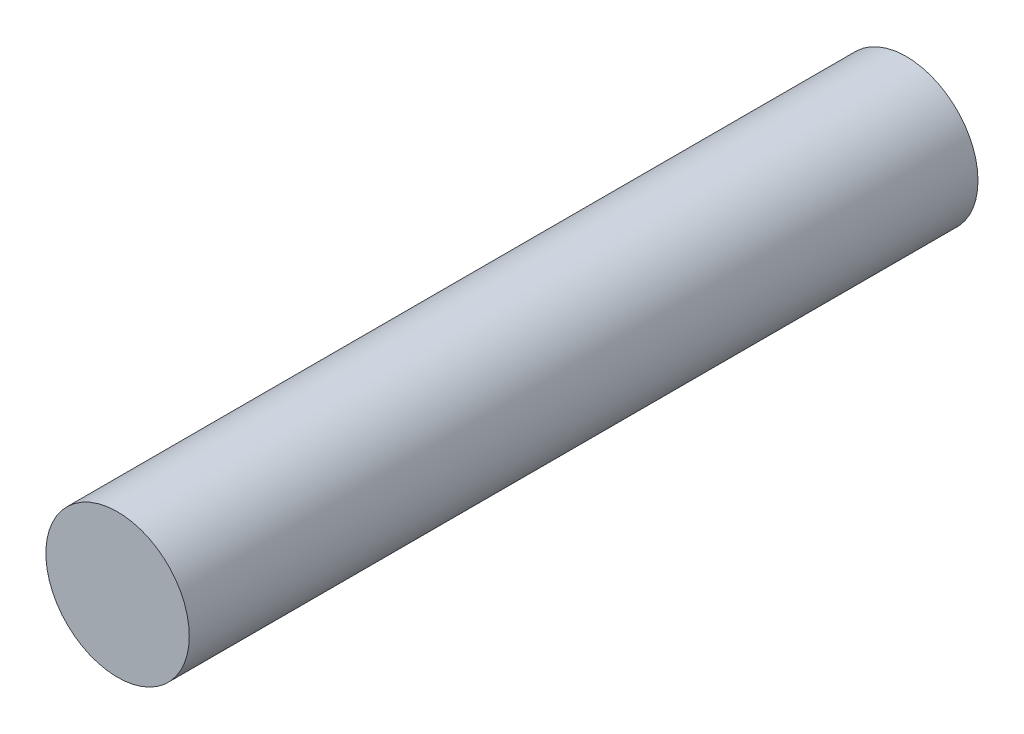
ISO-10303-21;
HEADER;
FILE_DESCRIPTION(('STEP AP214'),'2;1');
FILE_NAME('part.step','',(''),(''),'','','');
FILE_SCHEMA(('AUTOMOTIVE_DESIGN { 1 0 10303 214 1 1 1 1 }'));
ENDSEC;
DATA;
#1=APPLICATION_CONTEXT('core data for automotive mechanical design processes');
#2=APPLICATION_PROTOCOL_DEFINITION('international standard','automotive_design',2000,#1);
#3=PRODUCT_CONTEXT('',#1,'mechanical');
#4=PRODUCT('Part','Part','',(#3));
#5=PRODUCT_RELATED_PRODUCT_CATEGORY('part','',(#4));
#6=PRODUCT_DEFINITION_FORMATION('','',#4);
#7=PRODUCT_DEFINITION_CONTEXT('part definition',#1,'design');
#8=PRODUCT_DEFINITION('design','',#6,#7);
#9=PRODUCT_DEFINITION_SHAPE('','',#8);
#10=(LENGTH_UNIT() NAMED_UNIT(*) SI_UNIT(.MILLI.,.METRE.));
#11=(NAMED_UNIT(*) PLANE_ANGLE_UNIT() SI_UNIT($,.RADIAN.));
#12=(NAMED_UNIT(*) SI_UNIT($,.STERADIAN.) SOLID_ANGLE_UNIT());
#13=UNCERTAINTY_MEASURE_WITH_UNIT(LENGTH_MEASURE(1.E-05),#10,'distance_accuracy_value','');
#14=(GEOMETRIC_REPRESENTATION_CONTEXT(3) GLOBAL_UNCERTAINTY_ASSIGNED_CONTEXT((#13)) GLOBAL_UNIT_ASSIGNED_CONTEXT((#10,
#11,#12)) REPRESENTATION_CONTEXT('',''));
#15=CARTESIAN_POINT('',(0.,0.,0.));
#16=DIRECTION('',(0.,0.,1.));
#17=DIRECTION('',(1.,0.,0.));
#18=AXIS2_PLACEMENT_3D('',#15,#16,#17);
#19=CARTESIAN_POINT('',(0.,0.,33.));
#20=DIRECTION('',(0.,0.,-1.));
#21=DIRECTION('',(-1.,0.,0.));
#22=AXIS2_PLACEMENT_3D('',#19,#20,#21);
#23=CYLINDRICAL_SURFACE('',#22,3.);
#24=CARTESIAN_POINT('',(0.,0.,33.));
#25=DIRECTION('',(0.,0.,1.));
#26=DIRECTION('',(1.,0.,0.));
#27=AXIS2_PLACEMENT_3D('',#24,#25,#26);
#28=CIRCLE('',#27,3.);
#29=CARTESIAN_POINT('',(3.,0.,33.));
#30=VERTEX_POINT('',#29);
#31=EDGE_CURVE('E10',#30,#30,#28,.T.);
#32=ORIENTED_EDGE('',*,*,#31,.F.);
#33=EDGE_LOOP('',(#32));
#34=FACE_BOUND('',#33,.T.);
#35=CARTESIAN_POINT('',(0.,0.,0.));
#36=DIRECTION('',(0.,0.,1.));
#37=DIRECTION('',(1.,0.,0.));
#38=AXIS2_PLACEMENT_3D('',#35,#36,#37);
#39=CIRCLE('',#38,3.);
#40=CARTESIAN_POINT('',(3.,0.,0.));
#41=VERTEX_POINT('',#40);
#42=EDGE_CURVE('E37',#41,#41,#39,.T.);
#43=ORIENTED_EDGE('',*,*,#42,.T.);
#44=EDGE_LOOP('',(#43));
#45=FACE_BOUND('',#44,.T.);
#46=ADVANCED_FACE('F34',(#34,#45),#23,.T.);
#47=CARTESIAN_POINT('',(0.,0.,33.));
#48=DIRECTION('',(0.,0.,1.));
#49=DIRECTION('',(1.,0.,0.));
#50=AXIS2_PLACEMENT_3D('',#47,#48,#49);
#51=PLANE('',#50);
#52=ORIENTED_EDGE('',*,*,#31,.T.);
#53=EDGE_LOOP('',(#52));
#54=FACE_BOUND('',#53,.T.);
#55=ADVANCED_FACE('F49',(#54),#51,.T.);
#56=CARTESIAN_POINT('',(0.,0.,0.));
#57=DIRECTION('',(0.,0.,1.));
#58=DIRECTION('',(1.,0.,0.));
#59=AXIS2_PLACEMENT_3D('',#56,#57,#58);
#60=PLANE('',#59);
#61=ORIENTED_EDGE('',*,*,#42,.F.);
#62=EDGE_LOOP('',(#61));
#63=FACE_BOUND('',#62,.T.);
#64=ADVANCED_FACE('F47',(#63),#60,.F.);
#65=CLOSED_SHELL('',(#46,#55,#64));
#66=MANIFOLD_SOLID_BREP('B2',#65);
#67=ADVANCED_BREP_SHAPE_REPRESENTATION('',(#18,#66),#14);
#68=SHAPE_DEFINITION_REPRESENTATION(#9,#67);
ENDSEC;
END-ISO-10303-21;
